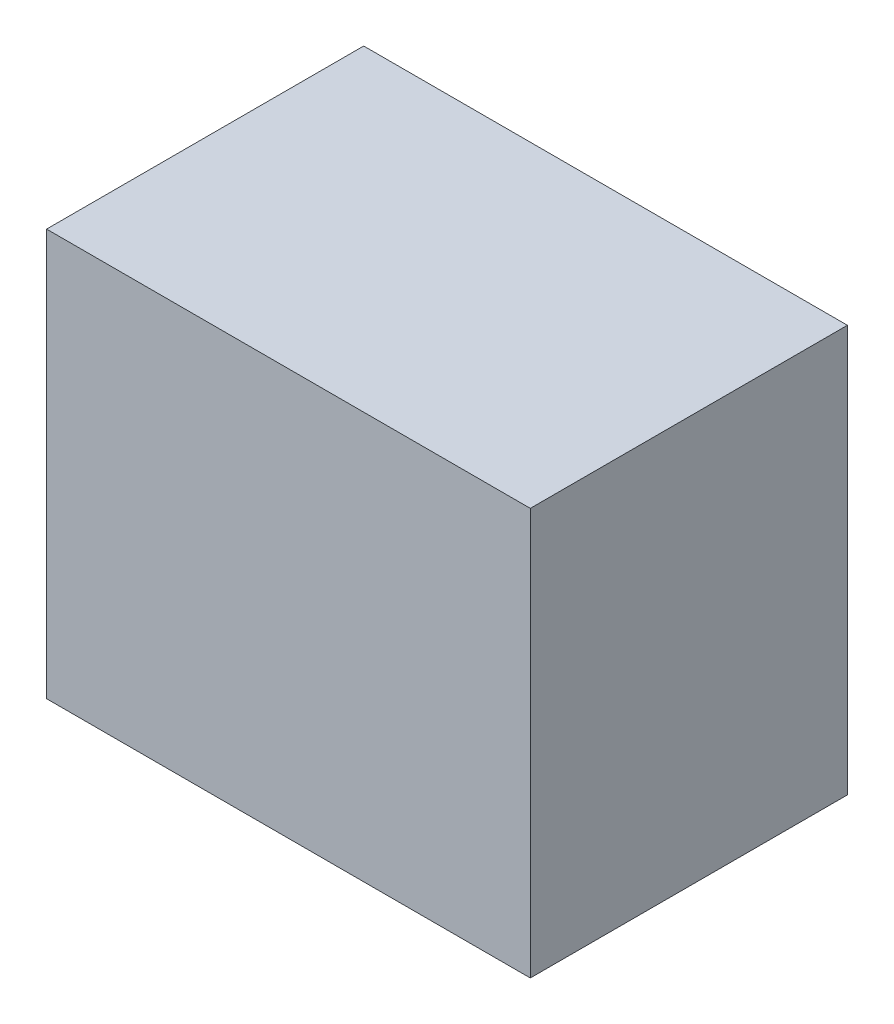
ISO-10303-21;
HEADER;
FILE_DESCRIPTION(('STEP AP214'),'2;1');
FILE_NAME('part.step','',(''),(''),'','','');
FILE_SCHEMA(('AUTOMOTIVE_DESIGN { 1 0 10303 214 1 1 1 1 }'));
ENDSEC;
DATA;
#1=APPLICATION_CONTEXT('core data for automotive mechanical design processes');
#2=APPLICATION_PROTOCOL_DEFINITION('international standard','automotive_design',2000,#1);
#3=PRODUCT_CONTEXT('',#1,'mechanical');
#4=PRODUCT('Part','Part','',(#3));
#5=PRODUCT_RELATED_PRODUCT_CATEGORY('part','',(#4));
#6=PRODUCT_DEFINITION_FORMATION('','',#4);
#7=PRODUCT_DEFINITION_CONTEXT('part definition',#1,'design');
#8=PRODUCT_DEFINITION('design','',#6,#7);
#9=PRODUCT_DEFINITION_SHAPE('','',#8);
#10=(LENGTH_UNIT() NAMED_UNIT(*) SI_UNIT(.MILLI.,.METRE.));
#11=(NAMED_UNIT(*) PLANE_ANGLE_UNIT() SI_UNIT($,.RADIAN.));
#12=(NAMED_UNIT(*) SI_UNIT($,.STERADIAN.) SOLID_ANGLE_UNIT());
#13=UNCERTAINTY_MEASURE_WITH_UNIT(LENGTH_MEASURE(1.E-05),#10,'distance_accuracy_value','');
#14=(GEOMETRIC_REPRESENTATION_CONTEXT(3) GLOBAL_UNCERTAINTY_ASSIGNED_CONTEXT((#13)) GLOBAL_UNIT_ASSIGNED_CONTEXT((#10,
#11,#12)) REPRESENTATION_CONTEXT('',''));
#15=CARTESIAN_POINT('',(0.,0.,0.));
#16=DIRECTION('',(0.,0.,1.));
#17=DIRECTION('',(1.,0.,0.));
#18=AXIS2_PLACEMENT_3D('',#15,#16,#17);
#19=CARTESIAN_POINT('',(0.,89.916,0.));
#20=DIRECTION('',(1.,0.,0.));
#21=DIRECTION('',(0.,0.,-1.));
#22=AXIS2_PLACEMENT_3D('',#19,#20,#21);
#23=PLANE('',#22);
#24=DIRECTION('',(0.,0.,1.));
#25=VECTOR('',#24,1.);
#26=CARTESIAN_POINT('',(0.,0.,0.));
#27=LINE('',#26,#25);
#28=CARTESIAN_POINT('',(0.,0.,-70.104));
#29=VERTEX_POINT('',#28);
#30=CARTESIAN_POINT('',(0.,0.,0.));
#31=VERTEX_POINT('',#30);
#32=EDGE_CURVE('E96',#29,#31,#27,.T.);
#33=ORIENTED_EDGE('',*,*,#32,.T.);
#34=DIRECTION('',(0.,-1.,0.));
#35=VECTOR('',#34,1.);
#36=CARTESIAN_POINT('',(0.,89.916,0.));
#37=LINE('',#36,#35);
#38=CARTESIAN_POINT('',(0.,89.916,0.));
#39=VERTEX_POINT('',#38);
#40=EDGE_CURVE('E11',#39,#31,#37,.T.);
#41=ORIENTED_EDGE('',*,*,#40,.F.);
#42=DIRECTION('',(0.,0.,1.));
#43=VECTOR('',#42,1.);
#44=CARTESIAN_POINT('',(0.,89.916,0.));
#45=LINE('',#44,#43);
#46=CARTESIAN_POINT('',(0.,89.916,-70.104));
#47=VERTEX_POINT('',#46);
#48=EDGE_CURVE('E84',#47,#39,#45,.T.);
#49=ORIENTED_EDGE('',*,*,#48,.F.);
#50=DIRECTION('',(0.,-1.,0.));
#51=VECTOR('',#50,1.);
#52=CARTESIAN_POINT('',(0.,89.916,-70.104));
#53=LINE('',#52,#51);
#54=EDGE_CURVE('E92',#47,#29,#53,.T.);
#55=ORIENTED_EDGE('',*,*,#54,.T.);
#56=EDGE_LOOP('',(#33,#41,#49,#55));
#57=FACE_BOUND('',#56,.T.);
#58=ADVANCED_FACE('F33',(#57),#23,.F.);
#59=CARTESIAN_POINT('',(0.,89.916,0.));
#60=DIRECTION('',(0.,0.,-1.));
#61=DIRECTION('',(-1.,0.,0.));
#62=AXIS2_PLACEMENT_3D('',#59,#60,#61);
#63=PLANE('',#62);
#64=DIRECTION('',(1.,0.,0.));
#65=VECTOR('',#64,1.);
#66=CARTESIAN_POINT('',(0.,0.,0.));
#67=LINE('',#66,#65);
#68=CARTESIAN_POINT('',(106.934,0.,0.));
#69=VERTEX_POINT('',#68);
#70=EDGE_CURVE('E88',#31,#69,#67,.T.);
#71=ORIENTED_EDGE('',*,*,#70,.T.);
#72=DIRECTION('',(0.,-1.,0.));
#73=VECTOR('',#72,1.);
#74=CARTESIAN_POINT('',(106.934,89.916,0.));
#75=LINE('',#74,#73);
#76=CARTESIAN_POINT('',(106.934,89.916,0.));
#77=VERTEX_POINT('',#76);
#78=EDGE_CURVE('E41',#77,#69,#75,.T.);
#79=ORIENTED_EDGE('',*,*,#78,.F.);
#80=DIRECTION('',(1.,0.,0.));
#81=VECTOR('',#80,1.);
#82=CARTESIAN_POINT('',(0.,89.916,0.));
#83=LINE('',#82,#81);
#84=EDGE_CURVE('E79',#39,#77,#83,.T.);
#85=ORIENTED_EDGE('',*,*,#84,.F.);
#86=ORIENTED_EDGE('',*,*,#40,.T.);
#87=EDGE_LOOP('',(#71,#79,#85,#86));
#88=FACE_BOUND('',#87,.T.);
#89=ADVANCED_FACE('F87',(#88),#63,.F.);
#90=CARTESIAN_POINT('',(106.934,89.916,0.));
#91=DIRECTION('',(-1.,0.,0.));
#92=DIRECTION('',(0.,0.,1.));
#93=AXIS2_PLACEMENT_3D('',#90,#91,#92);
#94=PLANE('',#93);
#95=DIRECTION('',(0.,0.,-1.));
#96=VECTOR('',#95,1.);
#97=CARTESIAN_POINT('',(106.934,0.,0.));
#98=LINE('',#97,#96);
#99=CARTESIAN_POINT('',(106.934,0.,-70.104));
#100=VERTEX_POINT('',#99);
#101=EDGE_CURVE('E66',#69,#100,#98,.T.);
#102=ORIENTED_EDGE('',*,*,#101,.T.);
#103=DIRECTION('',(0.,-1.,0.));
#104=VECTOR('',#103,1.);
#105=CARTESIAN_POINT('',(106.934,89.916,-70.104));
#106=LINE('',#105,#104);
#107=CARTESIAN_POINT('',(106.934,89.916,-70.104));
#108=VERTEX_POINT('',#107);
#109=EDGE_CURVE('E89',#108,#100,#106,.T.);
#110=ORIENTED_EDGE('',*,*,#109,.F.);
#111=DIRECTION('',(0.,0.,-1.));
#112=VECTOR('',#111,1.);
#113=CARTESIAN_POINT('',(106.934,89.916,0.));
#114=LINE('',#113,#112);
#115=EDGE_CURVE('E82',#77,#108,#114,.T.);
#116=ORIENTED_EDGE('',*,*,#115,.F.);
#117=ORIENTED_EDGE('',*,*,#78,.T.);
#118=EDGE_LOOP('',(#102,#110,#116,#117));
#119=FACE_BOUND('',#118,.T.);
#120=ADVANCED_FACE('F90',(#119),#94,.F.);
#121=CARTESIAN_POINT('',(0.,89.916,-70.104));
#122=DIRECTION('',(0.,0.,1.));
#123=DIRECTION('',(1.,0.,0.));
#124=AXIS2_PLACEMENT_3D('',#121,#122,#123);
#125=PLANE('',#124);
#126=DIRECTION('',(-1.,0.,0.));
#127=VECTOR('',#126,1.);
#128=CARTESIAN_POINT('',(0.,0.,-70.104));
#129=LINE('',#128,#127);
#130=EDGE_CURVE('E72',#100,#29,#129,.T.);
#131=ORIENTED_EDGE('',*,*,#130,.T.);
#132=ORIENTED_EDGE('',*,*,#54,.F.);
#133=DIRECTION('',(-1.,0.,0.));
#134=VECTOR('',#133,1.);
#135=CARTESIAN_POINT('',(0.,89.916,-70.104));
#136=LINE('',#135,#134);
#137=EDGE_CURVE('E49',#108,#47,#136,.T.);
#138=ORIENTED_EDGE('',*,*,#137,.F.);
#139=ORIENTED_EDGE('',*,*,#109,.T.);
#140=EDGE_LOOP('',(#131,#132,#138,#139));
#141=FACE_BOUND('',#140,.T.);
#142=ADVANCED_FACE('F103',(#141),#125,.F.);
#143=CARTESIAN_POINT('',(0.,89.916,0.));
#144=DIRECTION('',(0.,-1.,0.));
#145=DIRECTION('',(0.,0.,-1.));
#146=AXIS2_PLACEMENT_3D('',#143,#144,#145);
#147=PLANE('',#146);
#148=ORIENTED_EDGE('',*,*,#48,.T.);
#149=ORIENTED_EDGE('',*,*,#84,.T.);
#150=ORIENTED_EDGE('',*,*,#115,.T.);
#151=ORIENTED_EDGE('',*,*,#137,.T.);
#152=EDGE_LOOP('',(#148,#149,#150,#151));
#153=FACE_BOUND('',#152,.T.);
#154=ADVANCED_FACE('F80',(#153),#147,.F.);
#155=CARTESIAN_POINT('',(0.,0.,0.));
#156=DIRECTION('',(0.,-1.,0.));
#157=DIRECTION('',(0.,0.,-1.));
#158=AXIS2_PLACEMENT_3D('',#155,#156,#157);
#159=PLANE('',#158);
#160=ORIENTED_EDGE('',*,*,#32,.F.);
#161=ORIENTED_EDGE('',*,*,#130,.F.);
#162=ORIENTED_EDGE('',*,*,#101,.F.);
#163=ORIENTED_EDGE('',*,*,#70,.F.);
#164=EDGE_LOOP('',(#160,#161,#162,#163));
#165=FACE_BOUND('',#164,.T.);
#166=ADVANCED_FACE('F106',(#165),#159,.T.);
#167=CLOSED_SHELL('',(#58,#89,#120,#142,#154,#166));
#168=MANIFOLD_SOLID_BREP('B2',#167);
#169=ADVANCED_BREP_SHAPE_REPRESENTATION('',(#18,#168),#14);
#170=SHAPE_DEFINITION_REPRESENTATION(#9,#169);
ENDSEC;
END-ISO-10303-21;
